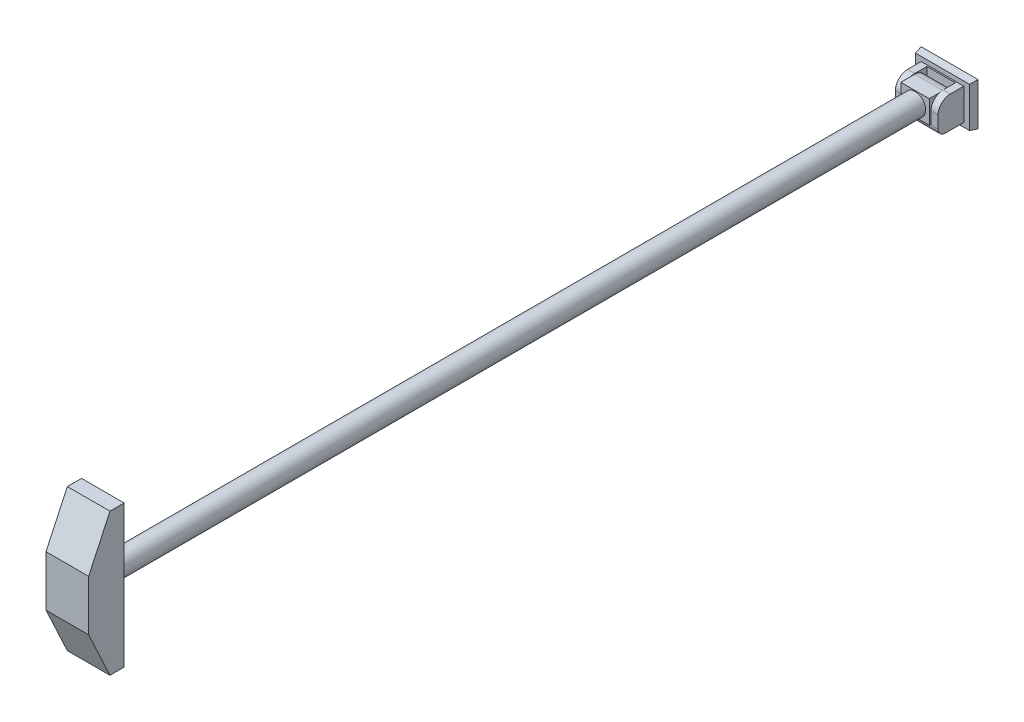
ISO-10303-21;
HEADER;
FILE_DESCRIPTION(('STEP AP214'),'2;1');
FILE_NAME('part.step','',(''),(''),'','','');
FILE_SCHEMA(('AUTOMOTIVE_DESIGN { 1 0 10303 214 1 1 1 1 }'));
ENDSEC;
DATA;
#1=APPLICATION_CONTEXT('core data for automotive mechanical design processes');
#2=APPLICATION_PROTOCOL_DEFINITION('international standard','automotive_design',2000,#1);
#3=PRODUCT_CONTEXT('',#1,'mechanical');
#4=PRODUCT('Part','Part','',(#3));
#5=PRODUCT_RELATED_PRODUCT_CATEGORY('part','',(#4));
#6=PRODUCT_DEFINITION_FORMATION('','',#4);
#7=PRODUCT_DEFINITION_CONTEXT('part definition',#1,'design');
#8=PRODUCT_DEFINITION('design','',#6,#7);
#9=PRODUCT_DEFINITION_SHAPE('','',#8);
#10=(LENGTH_UNIT() NAMED_UNIT(*) SI_UNIT(.MILLI.,.METRE.));
#11=(NAMED_UNIT(*) PLANE_ANGLE_UNIT() SI_UNIT($,.RADIAN.));
#12=(NAMED_UNIT(*) SI_UNIT($,.STERADIAN.) SOLID_ANGLE_UNIT());
#13=UNCERTAINTY_MEASURE_WITH_UNIT(LENGTH_MEASURE(1.E-05),#10,'distance_accuracy_value','');
#14=(GEOMETRIC_REPRESENTATION_CONTEXT(3) GLOBAL_UNCERTAINTY_ASSIGNED_CONTEXT((#13)) GLOBAL_UNIT_ASSIGNED_CONTEXT((#10,
#11,#12)) REPRESENTATION_CONTEXT('',''));
#15=CARTESIAN_POINT('',(0.,0.,0.));
#16=DIRECTION('',(0.,0.,1.));
#17=DIRECTION('',(1.,0.,0.));
#18=AXIS2_PLACEMENT_3D('',#15,#16,#17);
#19=CARTESIAN_POINT('',(-68.3445670265311,20.9540642702172,48.6015988488939));
#20=DIRECTION('',(0.,0.,1.));
#21=DIRECTION('',(1.,0.,0.));
#22=AXIS2_PLACEMENT_3D('',#19,#20,#21);
#23=PLANE('',#22);
#24=DIRECTION('',(0.,1.,0.));
#25=VECTOR('',#24,1.);
#26=CARTESIAN_POINT('',(-20.,20.9540642702172,48.6015988488939));
#27=LINE('',#26,#25);
#28=CARTESIAN_POINT('',(-20.,-11.5155039384287,48.6015988488939));
#29=VERTEX_POINT('',#28);
#30=CARTESIAN_POINT('',(-20.,20.9540642702172,48.6015988488939));
#31=VERTEX_POINT('',#30);
#32=EDGE_CURVE('E267',#29,#31,#27,.T.);
#33=ORIENTED_EDGE('',*,*,#32,.F.);
#34=DIRECTION('',(1.,0.,0.));
#35=VECTOR('',#34,1.);
#36=CARTESIAN_POINT('',(-68.3445670265311,-11.5155039384287,48.6015988488939));
#37=LINE('',#36,#35);
#38=CARTESIAN_POINT('',(20.,-11.5155039384287,48.6015988488939));
#39=VERTEX_POINT('',#38);
#40=EDGE_CURVE('E295',#29,#39,#37,.T.);
#41=ORIENTED_EDGE('',*,*,#40,.T.);
#42=DIRECTION('',(0.,-1.,0.));
#43=VECTOR('',#42,1.);
#44=CARTESIAN_POINT('',(20.,20.9540642702172,48.6015988488939));
#45=LINE('',#44,#43);
#46=CARTESIAN_POINT('',(20.,20.9540642702172,48.6015988488939));
#47=VERTEX_POINT('',#46);
#48=EDGE_CURVE('E283',#47,#39,#45,.T.);
#49=ORIENTED_EDGE('',*,*,#48,.F.);
#50=DIRECTION('',(1.,0.,0.));
#51=VECTOR('',#50,1.);
#52=CARTESIAN_POINT('',(-68.3445670265311,20.9540642702172,48.6015988488939));
#53=LINE('',#52,#51);
#54=EDGE_CURVE('E292',#31,#47,#53,.T.);
#55=ORIENTED_EDGE('',*,*,#54,.F.);
#56=EDGE_LOOP('',(#33,#41,#49,#55));
#57=FACE_BOUND('',#56,.T.);
#58=CARTESIAN_POINT('',(0.,4.71928016589421,48.6015988488939));
#59=DIRECTION('',(0.,0.,1.));
#60=DIRECTION('',(1.,0.,0.));
#61=AXIS2_PLACEMENT_3D('',#58,#59,#60);
#62=CIRCLE('',#61,15.);
#63=CARTESIAN_POINT('',(15.,4.71928016589421,48.6015988488939));
#64=VERTEX_POINT('',#63);
#65=EDGE_CURVE('E232',#64,#64,#62,.T.);
#66=ORIENTED_EDGE('',*,*,#65,.F.);
#67=EDGE_LOOP('',(#66));
#68=FACE_BOUND('',#67,.T.);
#69=ADVANCED_FACE('F32',(#57,#68),#23,.T.);
#70=CARTESIAN_POINT('',(-30.,-22.3686206237099,46.2073731558568));
#71=DIRECTION('',(0.,0.,1.));
#72=DIRECTION('',(1.,0.,0.));
#73=AXIS2_PLACEMENT_3D('',#70,#71,#72);
#74=PLANE('',#73);
#75=DIRECTION('',(0.,-1.,0.));
#76=VECTOR('',#75,1.);
#77=CARTESIAN_POINT('',(-30.,-22.3686206237099,46.2073731558568));
#78=LINE('',#77,#76);
#79=CARTESIAN_POINT('',(-30.,4.71928016589421,46.2073731558568));
#80=VERTEX_POINT('',#79);
#81=CARTESIAN_POINT('',(-30.,-12.3686206237099,46.2073731558568));
#82=VERTEX_POINT('',#81);
#83=EDGE_CURVE('E365',#80,#82,#78,.T.);
#84=ORIENTED_EDGE('',*,*,#83,.T.);
#85=DIRECTION('',(1.,0.,0.));
#86=VECTOR('',#85,1.);
#87=CARTESIAN_POINT('',(-30.,-12.3686206237099,46.2073731558568));
#88=LINE('',#87,#86);
#89=CARTESIAN_POINT('',(-20.,-12.3686206237099,46.2073731558568));
#90=VERTEX_POINT('',#89);
#91=EDGE_CURVE('E416',#82,#90,#88,.T.);
#92=ORIENTED_EDGE('',*,*,#91,.T.);
#93=DIRECTION('',(0.,-1.,0.));
#94=VECTOR('',#93,1.);
#95=CARTESIAN_POINT('',(-20.,-12.4696427147611,46.2073731558568));
#96=LINE('',#95,#94);
#97=CARTESIAN_POINT('',(-20.,-11.5155039384287,46.2073731558568));
#98=VERTEX_POINT('',#97);
#99=EDGE_CURVE('E310',#98,#90,#96,.T.);
#100=ORIENTED_EDGE('',*,*,#99,.F.);
#101=CARTESIAN_POINT('',(-20.,4.71928016589421,46.2073731558568));
#102=VERTEX_POINT('',#101);
#103=EDGE_CURVE('E311',#102,#98,#96,.T.);
#104=ORIENTED_EDGE('',*,*,#103,.F.);
#105=DIRECTION('',(1.,0.,0.));
#106=VECTOR('',#105,1.);
#107=CARTESIAN_POINT('',(-30.,4.71928016589421,46.2073731558568));
#108=LINE('',#107,#106);
#109=EDGE_CURVE('E375',#80,#102,#108,.T.);
#110=ORIENTED_EDGE('',*,*,#109,.F.);
#111=EDGE_LOOP('',(#84,#92,#100,#104,#110));
#112=FACE_BOUND('',#111,.T.);
#113=ADVANCED_FACE('F463',(#112),#74,.T.);
#114=CARTESIAN_POINT('',(-30.,4.71928016589421,29.0184502752014));
#115=DIRECTION('',(1.,0.,0.));
#116=DIRECTION('',(0.,0.,-1.));
#117=AXIS2_PLACEMENT_3D('',#114,#115,#116);
#118=CYLINDRICAL_SURFACE('',#117,17.1889228806553);
#119=ORIENTED_EDGE('',*,*,#109,.T.);
#120=CARTESIAN_POINT('',(-20.,4.71928016589421,29.0184502752014));
#121=DIRECTION('',(1.,0.,0.));
#122=DIRECTION('',(0.,0.,-1.));
#123=AXIS2_PLACEMENT_3D('',#120,#121,#122);
#124=CIRCLE('',#123,17.1889228806553);
#125=CARTESIAN_POINT('',(-20.,20.9540642702172,34.6656491280079));
#126=VERTEX_POINT('',#125);
#127=EDGE_CURVE('E307',#126,#102,#124,.T.);
#128=ORIENTED_EDGE('',*,*,#127,.F.);
#129=CARTESIAN_POINT('',(-20.,21.9082030465495,29.0184502752014));
#130=VERTEX_POINT('',#129);
#131=EDGE_CURVE('E308',#130,#126,#124,.T.);
#132=ORIENTED_EDGE('',*,*,#131,.F.);
#133=DIRECTION('',(1.,0.,0.));
#134=VECTOR('',#133,1.);
#135=CARTESIAN_POINT('',(-30.,21.9082030465495,29.0184502752014));
#136=LINE('',#135,#134);
#137=CARTESIAN_POINT('',(-30.,21.9082030465495,29.0184502752014));
#138=VERTEX_POINT('',#137);
#139=EDGE_CURVE('E379',#138,#130,#136,.T.);
#140=ORIENTED_EDGE('',*,*,#139,.F.);
#141=CARTESIAN_POINT('',(-30.,4.71928016589421,29.0184502752014));
#142=DIRECTION('',(1.,0.,0.));
#143=DIRECTION('',(0.,0.,1.));
#144=AXIS2_PLACEMENT_3D('',#141,#142,#143);
#145=CIRCLE('',#144,17.1889228806553);
#146=EDGE_CURVE('E362',#138,#80,#145,.T.);
#147=ORIENTED_EDGE('',*,*,#146,.T.);
#148=EDGE_LOOP('',(#119,#128,#132,#140,#147));
#149=FACE_BOUND('',#148,.T.);
#150=ADVANCED_FACE('F469',(#149),#118,.T.);
#151=CARTESIAN_POINT('',(40.,30.,0.));
#152=DIRECTION('',(0.984807753012208,0.,0.17364817766693));
#153=DIRECTION('',(0.17364817766693,0.,-0.984807753012208));
#154=AXIS2_PLACEMENT_3D('',#151,#152,#153);
#155=PLANE('',#154);
#156=DIRECTION('',(0.,1.,0.));
#157=VECTOR('',#156,1.);
#158=CARTESIAN_POINT('',(40.,30.,0.));
#159=LINE('',#158,#157);
#160=CARTESIAN_POINT('',(40.,-30.,0.));
#161=VERTEX_POINT('',#160);
#162=CARTESIAN_POINT('',(40.,30.,0.));
#163=VERTEX_POINT('',#162);
#164=EDGE_CURVE('E374',#161,#163,#159,.T.);
#165=ORIENTED_EDGE('',*,*,#164,.T.);
#166=DIRECTION('',(0.171087869746036,0.171087869746036,-0.970287525247814));
#167=VECTOR('',#166,1.);
#168=CARTESIAN_POINT('',(37.6583152660611,27.6583152660611,13.2803540588641));
#169=LINE('',#168,#167);
#170=CARTESIAN_POINT('',(38.2367301929153,28.2367301929154,10.));
#171=VERTEX_POINT('',#170);
#172=EDGE_CURVE('E394',#171,#163,#169,.T.);
#173=ORIENTED_EDGE('',*,*,#172,.F.);
#174=DIRECTION('',(0.,-1.,0.));
#175=VECTOR('',#174,1.);
#176=CARTESIAN_POINT('',(38.2367301929153,30.,10.));
#177=LINE('',#176,#175);
#178=CARTESIAN_POINT('',(38.2367301929153,-28.2367301929153,10.));
#179=VERTEX_POINT('',#178);
#180=EDGE_CURVE('E393',#179,#171,#177,.F.);
#181=ORIENTED_EDGE('',*,*,#180,.F.);
#182=DIRECTION('',(0.171087869746036,-0.171087869746036,-0.970287525247814));
#183=VECTOR('',#182,1.);
#184=CARTESIAN_POINT('',(38.2437364495458,-28.2437364495458,9.96026554414807));
#185=LINE('',#184,#183);
#186=EDGE_CURVE('E399',#179,#161,#185,.T.);
#187=ORIENTED_EDGE('',*,*,#186,.T.);
#188=EDGE_LOOP('',(#165,#173,#181,#187));
#189=FACE_BOUND('',#188,.T.);
#190=ADVANCED_FACE('F539',(#189),#155,.T.);
#191=CARTESIAN_POINT('',(-40.,30.,0.));
#192=DIRECTION('',(0.,0.984807753012208,0.17364817766693));
#193=DIRECTION('',(0.,-0.17364817766693,0.984807753012208));
#194=AXIS2_PLACEMENT_3D('',#191,#192,#193);
#195=PLANE('',#194);
#196=DIRECTION('',(-1.,0.,0.));
#197=VECTOR('',#196,1.);
#198=CARTESIAN_POINT('',(-40.,30.,0.));
#199=LINE('',#198,#197);
#200=CARTESIAN_POINT('',(-40.,30.,0.));
#201=VERTEX_POINT('',#200);
#202=EDGE_CURVE('E387',#163,#201,#199,.T.);
#203=ORIENTED_EDGE('',*,*,#202,.T.);
#204=DIRECTION('',(-0.171087869746036,0.171087869746036,-0.970287525247814));
#205=VECTOR('',#204,1.);
#206=CARTESIAN_POINT('',(-40.,30.,0.));
#207=LINE('',#206,#205);
#208=CARTESIAN_POINT('',(-38.2367301929154,28.2367301929154,10.));
#209=VERTEX_POINT('',#208);
#210=EDGE_CURVE('E398',#209,#201,#207,.T.);
#211=ORIENTED_EDGE('',*,*,#210,.F.);
#212=DIRECTION('',(1.,0.,0.));
#213=VECTOR('',#212,1.);
#214=CARTESIAN_POINT('',(-40.,28.2367301929154,10.));
#215=LINE('',#214,#213);
#216=EDGE_CURVE('E410',#171,#209,#215,.F.);
#217=ORIENTED_EDGE('',*,*,#216,.F.);
#218=ORIENTED_EDGE('',*,*,#172,.T.);
#219=EDGE_LOOP('',(#203,#211,#217,#218));
#220=FACE_BOUND('',#219,.T.);
#221=ADVANCED_FACE('F542',(#220),#195,.T.);
#222=CARTESIAN_POINT('',(-40.,30.,0.));
#223=DIRECTION('',(-0.984807753012208,0.,0.17364817766693));
#224=DIRECTION('',(0.17364817766693,0.,0.984807753012208));
#225=AXIS2_PLACEMENT_3D('',#222,#223,#224);
#226=PLANE('',#225);
#227=DIRECTION('',(0.,-1.,0.));
#228=VECTOR('',#227,1.);
#229=CARTESIAN_POINT('',(-40.,30.,0.));
#230=LINE('',#229,#228);
#231=CARTESIAN_POINT('',(-40.,-30.,0.));
#232=VERTEX_POINT('',#231);
#233=EDGE_CURVE('E389',#201,#232,#230,.T.);
#234=ORIENTED_EDGE('',*,*,#233,.T.);
#235=DIRECTION('',(-0.171087869746036,-0.171087869746036,-0.970287525247814));
#236=VECTOR('',#235,1.);
#237=CARTESIAN_POINT('',(-40.,-30.,0.));
#238=LINE('',#237,#236);
#239=CARTESIAN_POINT('',(-38.2367301929154,-28.2367301929153,10.));
#240=VERTEX_POINT('',#239);
#241=EDGE_CURVE('E402',#240,#232,#238,.T.);
#242=ORIENTED_EDGE('',*,*,#241,.F.);
#243=DIRECTION('',(0.,1.,0.));
#244=VECTOR('',#243,1.);
#245=CARTESIAN_POINT('',(-38.2367301929154,30.,10.));
#246=LINE('',#245,#244);
#247=EDGE_CURVE('E412',#209,#240,#246,.F.);
#248=ORIENTED_EDGE('',*,*,#247,.F.);
#249=ORIENTED_EDGE('',*,*,#210,.T.);
#250=EDGE_LOOP('',(#234,#242,#248,#249));
#251=FACE_BOUND('',#250,.T.);
#252=ADVANCED_FACE('F546',(#251),#226,.T.);
#253=CARTESIAN_POINT('',(-40.,-30.,0.));
#254=DIRECTION('',(0.,-0.984807753012208,0.17364817766693));
#255=DIRECTION('',(0.,-0.17364817766693,-0.984807753012208));
#256=AXIS2_PLACEMENT_3D('',#253,#254,#255);
#257=PLANE('',#256);
#258=DIRECTION('',(1.,0.,0.));
#259=VECTOR('',#258,1.);
#260=CARTESIAN_POINT('',(-40.,-30.,0.));
#261=LINE('',#260,#259);
#262=EDGE_CURVE('E391',#232,#161,#261,.T.);
#263=ORIENTED_EDGE('',*,*,#262,.T.);
#264=ORIENTED_EDGE('',*,*,#186,.F.);
#265=DIRECTION('',(-1.,0.,0.));
#266=VECTOR('',#265,1.);
#267=CARTESIAN_POINT('',(-40.,-28.2367301929153,10.));
#268=LINE('',#267,#266);
#269=EDGE_CURVE('E403',#240,#179,#268,.F.);
#270=ORIENTED_EDGE('',*,*,#269,.F.);
#271=ORIENTED_EDGE('',*,*,#241,.T.);
#272=EDGE_LOOP('',(#263,#264,#270,#271));
#273=FACE_BOUND('',#272,.T.);
#274=ADVANCED_FACE('F534',(#273),#257,.T.);
#275=CARTESIAN_POINT('',(0.,0.,10.));
#276=DIRECTION('',(0.,0.,1.));
#277=DIRECTION('',(1.,0.,0.));
#278=AXIS2_PLACEMENT_3D('',#275,#276,#277);
#279=PLANE('',#278);
#280=DIRECTION('',(0.,1.,0.));
#281=VECTOR('',#280,1.);
#282=CARTESIAN_POINT('',(-30.,21.9082030465495,10.));
#283=LINE('',#282,#281);
#284=CARTESIAN_POINT('',(-30.,-22.3686206237099,10.));
#285=VERTEX_POINT('',#284);
#286=CARTESIAN_POINT('',(-30.,21.9082030465495,10.));
#287=VERTEX_POINT('',#286);
#288=EDGE_CURVE('E356',#285,#287,#283,.T.);
#289=ORIENTED_EDGE('',*,*,#288,.T.);
#290=DIRECTION('',(1.,0.,0.));
#291=VECTOR('',#290,1.);
#292=CARTESIAN_POINT('',(-30.,21.9082030465495,10.));
#293=LINE('',#292,#291);
#294=CARTESIAN_POINT('',(30.,21.9082030465495,10.));
#295=VERTEX_POINT('',#294);
#296=EDGE_CURVE('E370',#287,#295,#293,.T.);
#297=ORIENTED_EDGE('',*,*,#296,.T.);
#298=DIRECTION('',(0.,1.,0.));
#299=VECTOR('',#298,1.);
#300=CARTESIAN_POINT('',(30.,21.9082030465495,10.));
#301=LINE('',#300,#299);
#302=CARTESIAN_POINT('',(30.,-22.3686206237099,10.));
#303=VERTEX_POINT('',#302);
#304=EDGE_CURVE('E342',#303,#295,#301,.T.);
#305=ORIENTED_EDGE('',*,*,#304,.F.);
#306=DIRECTION('',(1.,0.,0.));
#307=VECTOR('',#306,1.);
#308=CARTESIAN_POINT('',(-30.,-22.3686206237099,10.));
#309=LINE('',#308,#307);
#310=EDGE_CURVE('E371',#285,#303,#309,.T.);
#311=ORIENTED_EDGE('',*,*,#310,.F.);
#312=EDGE_LOOP('',(#289,#297,#305,#311));
#313=FACE_BOUND('',#312,.T.);
#314=ORIENTED_EDGE('',*,*,#180,.T.);
#315=ORIENTED_EDGE('',*,*,#216,.T.);
#316=ORIENTED_EDGE('',*,*,#247,.T.);
#317=ORIENTED_EDGE('',*,*,#269,.T.);
#318=EDGE_LOOP('',(#314,#315,#316,#317));
#319=FACE_BOUND('',#318,.T.);
#320=ADVANCED_FACE('F531',(#313,#319),#279,.T.);
#321=CARTESIAN_POINT('',(0.,0.,0.));
#322=DIRECTION('',(0.,0.,1.));
#323=DIRECTION('',(1.,0.,0.));
#324=AXIS2_PLACEMENT_3D('',#321,#322,#323);
#325=PLANE('',#324);
#326=ORIENTED_EDGE('',*,*,#164,.F.);
#327=ORIENTED_EDGE('',*,*,#262,.F.);
#328=ORIENTED_EDGE('',*,*,#233,.F.);
#329=ORIENTED_EDGE('',*,*,#202,.F.);
#330=EDGE_LOOP('',(#326,#327,#328,#329));
#331=FACE_BOUND('',#330,.T.);
#332=ADVANCED_FACE('F519',(#331),#325,.F.);
#333=CARTESIAN_POINT('',(-30.,-22.3686206237099,10.));
#334=DIRECTION('',(0.,-1.,0.));
#335=DIRECTION('',(0.,0.,-1.));
#336=AXIS2_PLACEMENT_3D('',#333,#334,#335);
#337=PLANE('',#336);
#338=DIRECTION('',(0.,0.,-1.));
#339=VECTOR('',#338,1.);
#340=CARTESIAN_POINT('',(30.,-22.3686206237099,10.));
#341=LINE('',#340,#339);
#342=CARTESIAN_POINT('',(30.,-22.3686206237099,36.2073731558568));
#343=VERTEX_POINT('',#342);
#344=EDGE_CURVE('E354',#343,#303,#341,.T.);
#345=ORIENTED_EDGE('',*,*,#344,.F.);
#346=DIRECTION('',(1.,0.,0.));
#347=VECTOR('',#346,1.);
#348=CARTESIAN_POINT('',(-30.,-22.3686206237099,36.2073731558568));
#349=LINE('',#348,#347);
#350=CARTESIAN_POINT('',(-30.,-22.3686206237099,36.2073731558568));
#351=VERTEX_POINT('',#350);
#352=EDGE_CURVE('E428',#343,#351,#349,.F.);
#353=ORIENTED_EDGE('',*,*,#352,.T.);
#354=DIRECTION('',(0.,0.,-1.));
#355=VECTOR('',#354,1.);
#356=CARTESIAN_POINT('',(-30.,-22.3686206237099,10.));
#357=LINE('',#356,#355);
#358=EDGE_CURVE('E368',#351,#285,#357,.T.);
#359=ORIENTED_EDGE('',*,*,#358,.T.);
#360=ORIENTED_EDGE('',*,*,#310,.T.);
#361=EDGE_LOOP('',(#345,#353,#359,#360));
#362=FACE_BOUND('',#361,.T.);
#363=ADVANCED_FACE('F517',(#362),#337,.T.);
#364=DIRECTION('',(0.,-1.,0.));
#365=VECTOR('',#364,1.);
#366=CARTESIAN_POINT('',(20.,-12.4696427147611,46.2073731558568));
#367=LINE('',#366,#365);
#368=CARTESIAN_POINT('',(20.,4.71928016589421,46.2073731558568));
#369=VERTEX_POINT('',#368);
#370=CARTESIAN_POINT('',(20.,-11.5155039384287,46.2073731558568));
#371=VERTEX_POINT('',#370);
#372=EDGE_CURVE('E329',#369,#371,#367,.T.);
#373=ORIENTED_EDGE('',*,*,#372,.T.);
#374=CARTESIAN_POINT('',(20.,-12.3686206237099,46.2073731558568));
#375=VERTEX_POINT('',#374);
#376=EDGE_CURVE('E328',#371,#375,#367,.T.);
#377=ORIENTED_EDGE('',*,*,#376,.T.);
#378=DIRECTION('',(1.,0.,0.));
#379=VECTOR('',#378,1.);
#380=CARTESIAN_POINT('',(-30.,-12.3686206237099,46.2073731558568));
#381=LINE('',#380,#379);
#382=CARTESIAN_POINT('',(30.,-12.3686206237099,46.2073731558568));
#383=VERTEX_POINT('',#382);
#384=EDGE_CURVE('E397',#375,#383,#381,.T.);
#385=ORIENTED_EDGE('',*,*,#384,.T.);
#386=DIRECTION('',(0.,-1.,0.));
#387=VECTOR('',#386,1.);
#388=CARTESIAN_POINT('',(30.,-22.3686206237099,46.2073731558568));
#389=LINE('',#388,#387);
#390=CARTESIAN_POINT('',(30.,4.71928016589421,46.2073731558568));
#391=VERTEX_POINT('',#390);
#392=EDGE_CURVE('E351',#391,#383,#389,.T.);
#393=ORIENTED_EDGE('',*,*,#392,.F.);
#394=EDGE_CURVE('E378',#369,#391,#108,.T.);
#395=ORIENTED_EDGE('',*,*,#394,.F.);
#396=EDGE_LOOP('',(#373,#377,#385,#393,#395));
#397=FACE_BOUND('',#396,.T.);
#398=ADVANCED_FACE('F472',(#397),#74,.T.);
#399=CARTESIAN_POINT('',(20.,4.71928016589421,29.0184502752014));
#400=DIRECTION('',(1.,0.,0.));
#401=DIRECTION('',(0.,0.,-1.));
#402=AXIS2_PLACEMENT_3D('',#399,#400,#401);
#403=CIRCLE('',#402,17.1889228806553);
#404=CARTESIAN_POINT('',(20.,21.9082030465495,29.0184502752014));
#405=VERTEX_POINT('',#404);
#406=CARTESIAN_POINT('',(20.,20.9540642702172,34.6656491280079));
#407=VERTEX_POINT('',#406);
#408=EDGE_CURVE('E325',#405,#407,#403,.T.);
#409=ORIENTED_EDGE('',*,*,#408,.T.);
#410=EDGE_CURVE('E324',#407,#369,#403,.T.);
#411=ORIENTED_EDGE('',*,*,#410,.T.);
#412=ORIENTED_EDGE('',*,*,#394,.T.);
#413=CARTESIAN_POINT('',(30.,4.71928016589421,29.0184502752014));
#414=DIRECTION('',(1.,0.,0.));
#415=DIRECTION('',(0.,0.,1.));
#416=AXIS2_PLACEMENT_3D('',#413,#414,#415);
#417=CIRCLE('',#416,17.1889228806553);
#418=CARTESIAN_POINT('',(30.,21.9082030465495,29.0184502752014));
#419=VERTEX_POINT('',#418);
#420=EDGE_CURVE('E348',#419,#391,#417,.T.);
#421=ORIENTED_EDGE('',*,*,#420,.F.);
#422=EDGE_CURVE('E382',#405,#419,#136,.T.);
#423=ORIENTED_EDGE('',*,*,#422,.F.);
#424=EDGE_LOOP('',(#409,#411,#412,#421,#423));
#425=FACE_BOUND('',#424,.T.);
#426=ADVANCED_FACE('F523',(#425),#118,.T.);
#427=CARTESIAN_POINT('',(-30.,21.9082030465495,29.0184502752014));
#428=DIRECTION('',(0.,1.,0.));
#429=DIRECTION('',(0.,0.,1.));
#430=AXIS2_PLACEMENT_3D('',#427,#428,#429);
#431=PLANE('',#430);
#432=DIRECTION('',(0.,0.,1.));
#433=VECTOR('',#432,1.);
#434=CARTESIAN_POINT('',(20.,21.9082030465495,11.8295273945461));
#435=LINE('',#434,#433);
#436=CARTESIAN_POINT('',(20.,21.9082030465495,11.8295273945461));
#437=VERTEX_POINT('',#436);
#438=EDGE_CURVE('E321',#437,#405,#435,.T.);
#439=ORIENTED_EDGE('',*,*,#438,.T.);
#440=ORIENTED_EDGE('',*,*,#422,.T.);
#441=DIRECTION('',(0.,0.,1.));
#442=VECTOR('',#441,1.);
#443=CARTESIAN_POINT('',(30.,21.9082030465495,29.0184502752014));
#444=LINE('',#443,#442);
#445=EDGE_CURVE('E345',#295,#419,#444,.T.);
#446=ORIENTED_EDGE('',*,*,#445,.F.);
#447=ORIENTED_EDGE('',*,*,#296,.F.);
#448=DIRECTION('',(0.,0.,1.));
#449=VECTOR('',#448,1.);
#450=CARTESIAN_POINT('',(-30.,21.9082030465495,29.0184502752014));
#451=LINE('',#450,#449);
#452=EDGE_CURVE('E359',#287,#138,#451,.T.);
#453=ORIENTED_EDGE('',*,*,#452,.T.);
#454=ORIENTED_EDGE('',*,*,#139,.T.);
#455=DIRECTION('',(0.,0.,1.));
#456=VECTOR('',#455,1.);
#457=CARTESIAN_POINT('',(-20.,21.9082030465495,11.8295273945461));
#458=LINE('',#457,#456);
#459=CARTESIAN_POINT('',(-20.,21.9082030465495,11.8295273945461));
#460=VERTEX_POINT('',#459);
#461=EDGE_CURVE('E305',#460,#130,#458,.T.);
#462=ORIENTED_EDGE('',*,*,#461,.F.);
#463=DIRECTION('',(-1.,0.,0.));
#464=VECTOR('',#463,1.);
#465=CARTESIAN_POINT('',(20.,21.9082030465495,11.8295273945461));
#466=LINE('',#465,#464);
#467=EDGE_CURVE('E337',#437,#460,#466,.T.);
#468=ORIENTED_EDGE('',*,*,#467,.F.);
#469=EDGE_LOOP('',(#439,#440,#446,#447,#453,#454,#462,#468));
#470=FACE_BOUND('',#469,.T.);
#471=ADVANCED_FACE('F515',(#470),#431,.T.);
#472=CARTESIAN_POINT('',(-30.,4.71928016589421,29.0184502752014));
#473=DIRECTION('',(-1.,0.,0.));
#474=DIRECTION('',(0.,0.,1.));
#475=AXIS2_PLACEMENT_3D('',#472,#473,#474);
#476=PLANE('',#475);
#477=ORIENTED_EDGE('',*,*,#358,.F.);
#478=CARTESIAN_POINT('',(-30.,-12.3686206237099,36.2073731558568));
#479=DIRECTION('',(-1.,0.,0.));
#480=DIRECTION('',(0.,0.,1.));
#481=AXIS2_PLACEMENT_3D('',#478,#479,#480);
#482=CIRCLE('',#481,10.);
#483=EDGE_CURVE('E430',#351,#82,#482,.T.);
#484=ORIENTED_EDGE('',*,*,#483,.T.);
#485=ORIENTED_EDGE('',*,*,#83,.F.);
#486=ORIENTED_EDGE('',*,*,#146,.F.);
#487=ORIENTED_EDGE('',*,*,#452,.F.);
#488=ORIENTED_EDGE('',*,*,#288,.F.);
#489=EDGE_LOOP('',(#477,#484,#485,#486,#487,#488));
#490=FACE_BOUND('',#489,.T.);
#491=ADVANCED_FACE('F511',(#490),#476,.T.);
#492=CARTESIAN_POINT('',(30.,4.71928016589421,29.0184502752014));
#493=DIRECTION('',(-1.,0.,0.));
#494=DIRECTION('',(0.,0.,1.));
#495=AXIS2_PLACEMENT_3D('',#492,#493,#494);
#496=PLANE('',#495);
#497=ORIENTED_EDGE('',*,*,#392,.T.);
#498=CARTESIAN_POINT('',(30.,-12.3686206237099,36.2073731558568));
#499=DIRECTION('',(-1.,0.,0.));
#500=DIRECTION('',(0.,0.,1.));
#501=AXIS2_PLACEMENT_3D('',#498,#499,#500);
#502=CIRCLE('',#501,10.);
#503=EDGE_CURVE('E426',#383,#343,#502,.F.);
#504=ORIENTED_EDGE('',*,*,#503,.T.);
#505=ORIENTED_EDGE('',*,*,#344,.T.);
#506=ORIENTED_EDGE('',*,*,#304,.T.);
#507=ORIENTED_EDGE('',*,*,#445,.T.);
#508=ORIENTED_EDGE('',*,*,#420,.T.);
#509=EDGE_LOOP('',(#497,#504,#505,#506,#507,#508));
#510=FACE_BOUND('',#509,.T.);
#511=ADVANCED_FACE('F507',(#510),#496,.F.);
#512=CARTESIAN_POINT('',(20.,4.71928016589421,29.0184502752014));
#513=DIRECTION('',(-1.,0.,0.));
#514=DIRECTION('',(0.,0.,1.));
#515=AXIS2_PLACEMENT_3D('',#512,#513,#514);
#516=CYLINDRICAL_SURFACE('',#515,17.1889228806553);
#517=DIRECTION('',(-1.,0.,0.));
#518=VECTOR('',#517,1.);
#519=CARTESIAN_POINT('',(20.,-12.4696427147611,29.0184502752014));
#520=LINE('',#519,#518);
#521=CARTESIAN_POINT('',(20.,-12.4696427147611,29.0184502752014));
#522=VERTEX_POINT('',#521);
#523=CARTESIAN_POINT('',(-20.,-12.4696427147611,29.0184502752014));
#524=VERTEX_POINT('',#523);
#525=EDGE_CURVE('E334',#522,#524,#520,.T.);
#526=ORIENTED_EDGE('',*,*,#525,.F.);
#527=CARTESIAN_POINT('',(20.,4.71928016589421,29.0184502752014));
#528=DIRECTION('',(1.,0.,0.));
#529=DIRECTION('',(0.,0.,-1.));
#530=AXIS2_PLACEMENT_3D('',#527,#528,#529);
#531=CIRCLE('',#530,17.1889228806553);
#532=CARTESIAN_POINT('',(20.,4.71928016589421,11.8295273945461));
#533=VERTEX_POINT('',#532);
#534=EDGE_CURVE('E316',#522,#533,#531,.T.);
#535=ORIENTED_EDGE('',*,*,#534,.T.);
#536=DIRECTION('',(-1.,0.,0.));
#537=VECTOR('',#536,1.);
#538=CARTESIAN_POINT('',(20.,4.71928016589421,11.8295273945461));
#539=LINE('',#538,#537);
#540=CARTESIAN_POINT('',(-20.,4.71928016589421,11.8295273945461));
#541=VERTEX_POINT('',#540);
#542=EDGE_CURVE('E340',#533,#541,#539,.T.);
#543=ORIENTED_EDGE('',*,*,#542,.T.);
#544=CARTESIAN_POINT('',(-20.,4.71928016589421,29.0184502752014));
#545=DIRECTION('',(1.,0.,0.));
#546=DIRECTION('',(0.,0.,-1.));
#547=AXIS2_PLACEMENT_3D('',#544,#545,#546);
#548=CIRCLE('',#547,17.1889228806553);
#549=EDGE_CURVE('E300',#524,#541,#548,.T.);
#550=ORIENTED_EDGE('',*,*,#549,.F.);
#551=EDGE_LOOP('',(#526,#535,#543,#550));
#552=FACE_BOUND('',#551,.T.);
#553=ADVANCED_FACE('F503',(#552),#516,.F.);
#554=CARTESIAN_POINT('',(20.,4.71928016589421,11.8295273945461));
#555=DIRECTION('',(0.,0.,1.));
#556=DIRECTION('',(1.,0.,0.));
#557=AXIS2_PLACEMENT_3D('',#554,#555,#556);
#558=PLANE('',#557);
#559=ORIENTED_EDGE('',*,*,#542,.F.);
#560=DIRECTION('',(0.,1.,0.));
#561=VECTOR('',#560,1.);
#562=CARTESIAN_POINT('',(20.,4.71928016589421,11.8295273945461));
#563=LINE('',#562,#561);
#564=EDGE_CURVE('E319',#533,#437,#563,.T.);
#565=ORIENTED_EDGE('',*,*,#564,.T.);
#566=ORIENTED_EDGE('',*,*,#467,.T.);
#567=DIRECTION('',(0.,1.,0.));
#568=VECTOR('',#567,1.);
#569=CARTESIAN_POINT('',(-20.,4.71928016589421,11.8295273945461));
#570=LINE('',#569,#568);
#571=EDGE_CURVE('E303',#541,#460,#570,.T.);
#572=ORIENTED_EDGE('',*,*,#571,.F.);
#573=EDGE_LOOP('',(#559,#565,#566,#572));
#574=FACE_BOUND('',#573,.T.);
#575=ADVANCED_FACE('F499',(#574),#558,.T.);
#576=CARTESIAN_POINT('',(20.,-12.4696427147611,29.0184502752014));
#577=DIRECTION('',(0.,1.,0.));
#578=DIRECTION('',(0.,0.,1.));
#579=AXIS2_PLACEMENT_3D('',#576,#577,#578);
#580=PLANE('',#579);
#581=DIRECTION('',(0.,0.,-1.));
#582=VECTOR('',#581,1.);
#583=CARTESIAN_POINT('',(-20.,-12.4696427147611,29.0184502752014));
#584=LINE('',#583,#582);
#585=CARTESIAN_POINT('',(-20.,-12.4696427147611,46.2068628696931));
#586=VERTEX_POINT('',#585);
#587=EDGE_CURVE('E314',#586,#524,#584,.T.);
#588=ORIENTED_EDGE('',*,*,#587,.F.);
#589=DIRECTION('',(1.,0.,0.));
#590=VECTOR('',#589,1.);
#591=CARTESIAN_POINT('',(-20.,-12.4696427147611,46.2068628696931));
#592=LINE('',#591,#590);
#593=CARTESIAN_POINT('',(20.,-12.4696427147611,46.2068628696931));
#594=VERTEX_POINT('',#593);
#595=EDGE_CURVE('E421',#586,#594,#592,.T.);
#596=ORIENTED_EDGE('',*,*,#595,.T.);
#597=DIRECTION('',(0.,0.,-1.));
#598=VECTOR('',#597,1.);
#599=CARTESIAN_POINT('',(20.,-12.4696427147611,29.0184502752014));
#600=LINE('',#599,#598);
#601=EDGE_CURVE('E332',#594,#522,#600,.T.);
#602=ORIENTED_EDGE('',*,*,#601,.T.);
#603=ORIENTED_EDGE('',*,*,#525,.T.);
#604=EDGE_LOOP('',(#588,#596,#602,#603));
#605=FACE_BOUND('',#604,.T.);
#606=ADVANCED_FACE('F495',(#605),#580,.T.);
#607=CARTESIAN_POINT('',(20.,4.71928016589421,29.0184502752014));
#608=DIRECTION('',(1.,0.,0.));
#609=DIRECTION('',(0.,0.,-1.));
#610=AXIS2_PLACEMENT_3D('',#607,#608,#609);
#611=PLANE('',#610);
#612=ORIENTED_EDGE('',*,*,#376,.F.);
#613=DIRECTION('',(0.,0.,-1.));
#614=VECTOR('',#613,1.);
#615=CARTESIAN_POINT('',(20.,-11.5155039384287,48.6015988488939));
#616=LINE('',#615,#614);
#617=CARTESIAN_POINT('',(20.,-11.5155039384287,29.0184502752014));
#618=VERTEX_POINT('',#617);
#619=EDGE_CURVE('E279',#371,#618,#616,.T.);
#620=ORIENTED_EDGE('',*,*,#619,.T.);
#621=CARTESIAN_POINT('',(20.,4.71928016589421,29.0184502752014));
#622=DIRECTION('',(-1.,0.,0.));
#623=DIRECTION('',(0.,0.,1.));
#624=AXIS2_PLACEMENT_3D('',#621,#622,#623);
#625=CIRCLE('',#624,16.234784104323);
#626=CARTESIAN_POINT('',(20.,20.9540642702172,29.0184502752014));
#627=VERTEX_POINT('',#626);
#628=EDGE_CURVE('E264',#627,#618,#625,.T.);
#629=ORIENTED_EDGE('',*,*,#628,.F.);
#630=DIRECTION('',(0.,0.,1.));
#631=VECTOR('',#630,1.);
#632=CARTESIAN_POINT('',(20.,20.9540642702172,29.0184502752014));
#633=LINE('',#632,#631);
#634=EDGE_CURVE('E287',#627,#407,#633,.T.);
#635=ORIENTED_EDGE('',*,*,#634,.T.);
#636=ORIENTED_EDGE('',*,*,#408,.F.);
#637=ORIENTED_EDGE('',*,*,#438,.F.);
#638=ORIENTED_EDGE('',*,*,#564,.F.);
#639=ORIENTED_EDGE('',*,*,#534,.F.);
#640=ORIENTED_EDGE('',*,*,#601,.F.);
#641=CARTESIAN_POINT('',(20.,-12.3686206237099,36.2073731558568));
#642=DIRECTION('',(1.,0.,0.));
#643=DIRECTION('',(0.,0.,-1.));
#644=AXIS2_PLACEMENT_3D('',#641,#642,#643);
#645=CIRCLE('',#644,10.);
#646=EDGE_CURVE('E423',#594,#375,#645,.F.);
#647=ORIENTED_EDGE('',*,*,#646,.T.);
#648=EDGE_LOOP('',(#612,#620,#629,#635,#636,#637,#638,#639,#640,#647));
#649=FACE_BOUND('',#648,.T.);
#650=ADVANCED_FACE('F491',(#649),#611,.F.);
#651=CARTESIAN_POINT('',(-20.,4.71928016589421,29.0184502752014));
#652=DIRECTION('',(1.,0.,0.));
#653=DIRECTION('',(0.,0.,-1.));
#654=AXIS2_PLACEMENT_3D('',#651,#652,#653);
#655=PLANE('',#654);
#656=DIRECTION('',(0.,0.,1.));
#657=VECTOR('',#656,1.);
#658=CARTESIAN_POINT('',(-20.,-11.5155039384287,48.6015988488939));
#659=LINE('',#658,#657);
#660=CARTESIAN_POINT('',(-20.,-11.5155039384287,29.0184502752014));
#661=VERTEX_POINT('',#660);
#662=EDGE_CURVE('E271',#661,#98,#659,.T.);
#663=ORIENTED_EDGE('',*,*,#662,.T.);
#664=ORIENTED_EDGE('',*,*,#99,.T.);
#665=CARTESIAN_POINT('',(-20.,-12.3686206237099,36.2073731558568));
#666=DIRECTION('',(1.,0.,0.));
#667=DIRECTION('',(0.,0.,-1.));
#668=AXIS2_PLACEMENT_3D('',#665,#666,#667);
#669=CIRCLE('',#668,10.);
#670=EDGE_CURVE('E419',#90,#586,#669,.T.);
#671=ORIENTED_EDGE('',*,*,#670,.T.);
#672=ORIENTED_EDGE('',*,*,#587,.T.);
#673=ORIENTED_EDGE('',*,*,#549,.T.);
#674=ORIENTED_EDGE('',*,*,#571,.T.);
#675=ORIENTED_EDGE('',*,*,#461,.T.);
#676=ORIENTED_EDGE('',*,*,#131,.T.);
#677=DIRECTION('',(0.,0.,1.));
#678=VECTOR('',#677,1.);
#679=CARTESIAN_POINT('',(-20.,20.9540642702172,29.0184502752014));
#680=LINE('',#679,#678);
#681=CARTESIAN_POINT('',(-20.,20.9540642702172,29.0184502752014));
#682=VERTEX_POINT('',#681);
#683=EDGE_CURVE('E432',#682,#126,#680,.T.);
#684=ORIENTED_EDGE('',*,*,#683,.F.);
#685=CARTESIAN_POINT('',(-20.,4.71928016589421,29.0184502752014));
#686=DIRECTION('',(1.,0.,0.));
#687=DIRECTION('',(0.,0.,-1.));
#688=AXIS2_PLACEMENT_3D('',#685,#686,#687);
#689=CIRCLE('',#688,16.234784104323);
#690=EDGE_CURVE('E273',#661,#682,#689,.T.);
#691=ORIENTED_EDGE('',*,*,#690,.F.);
#692=EDGE_LOOP('',(#663,#664,#671,#672,#673,#674,#675,#676,#684,#691));
#693=FACE_BOUND('',#692,.T.);
#694=ADVANCED_FACE('F488',(#693),#655,.T.);
#695=CARTESIAN_POINT('',(-30.,-12.3686206237099,36.2073731558568));
#696=DIRECTION('',(1.,0.,0.));
#697=DIRECTION('',(0.,0.,-1.));
#698=AXIS2_PLACEMENT_3D('',#695,#696,#697);
#699=CYLINDRICAL_SURFACE('',#698,10.);
#700=ORIENTED_EDGE('',*,*,#483,.F.);
#701=ORIENTED_EDGE('',*,*,#352,.F.);
#702=ORIENTED_EDGE('',*,*,#503,.F.);
#703=ORIENTED_EDGE('',*,*,#384,.F.);
#704=ORIENTED_EDGE('',*,*,#646,.F.);
#705=ORIENTED_EDGE('',*,*,#595,.F.);
#706=ORIENTED_EDGE('',*,*,#670,.F.);
#707=ORIENTED_EDGE('',*,*,#91,.F.);
#708=EDGE_LOOP('',(#700,#701,#702,#703,#704,#705,#706,#707));
#709=FACE_BOUND('',#708,.T.);
#710=ADVANCED_FACE('F486',(#709),#699,.T.);
#711=CARTESIAN_POINT('',(-68.3445670265311,4.71928016589421,29.0184502752014));
#712=DIRECTION('',(1.,0.,0.));
#713=DIRECTION('',(0.,0.,-1.));
#714=AXIS2_PLACEMENT_3D('',#711,#712,#713);
#715=CYLINDRICAL_SURFACE('',#714,16.234784104323);
#716=DIRECTION('',(1.,0.,0.));
#717=VECTOR('',#716,1.);
#718=CARTESIAN_POINT('',(-68.3445670265311,-11.5155039384287,29.0184502752014));
#719=LINE('',#718,#717);
#720=EDGE_CURVE('E270',#661,#618,#719,.T.);
#721=ORIENTED_EDGE('',*,*,#720,.F.);
#722=ORIENTED_EDGE('',*,*,#690,.T.);
#723=DIRECTION('',(1.,0.,0.));
#724=VECTOR('',#723,1.);
#725=CARTESIAN_POINT('',(-68.3445670265311,20.9540642702172,29.0184502752014));
#726=LINE('',#725,#724);
#727=EDGE_CURVE('E290',#682,#627,#726,.T.);
#728=ORIENTED_EDGE('',*,*,#727,.T.);
#729=ORIENTED_EDGE('',*,*,#628,.T.);
#730=EDGE_LOOP('',(#721,#722,#728,#729));
#731=FACE_BOUND('',#730,.T.);
#732=ADVANCED_FACE('F482',(#731),#715,.T.);
#733=CARTESIAN_POINT('',(-68.3445670265311,-11.5155039384287,48.6015988488939));
#734=DIRECTION('',(0.,-1.,0.));
#735=DIRECTION('',(0.,0.,-1.));
#736=AXIS2_PLACEMENT_3D('',#733,#734,#735);
#737=PLANE('',#736);
#738=ORIENTED_EDGE('',*,*,#662,.F.);
#739=ORIENTED_EDGE('',*,*,#720,.T.);
#740=ORIENTED_EDGE('',*,*,#619,.F.);
#741=EDGE_CURVE('E280',#39,#371,#616,.T.);
#742=ORIENTED_EDGE('',*,*,#741,.F.);
#743=ORIENTED_EDGE('',*,*,#40,.F.);
#744=EDGE_CURVE('E269',#98,#29,#659,.T.);
#745=ORIENTED_EDGE('',*,*,#744,.F.);
#746=EDGE_LOOP('',(#738,#739,#740,#742,#743,#745));
#747=FACE_BOUND('',#746,.T.);
#748=ADVANCED_FACE('F479',(#747),#737,.T.);
#749=CARTESIAN_POINT('',(-68.3445670265311,20.9540642702172,29.0184502752014));
#750=DIRECTION('',(0.,1.,0.));
#751=DIRECTION('',(0.,0.,1.));
#752=AXIS2_PLACEMENT_3D('',#749,#750,#751);
#753=PLANE('',#752);
#754=DIRECTION('',(0.,0.,-1.));
#755=VECTOR('',#754,1.);
#756=CARTESIAN_POINT('',(-20.,20.9540642702172,29.0184502752014));
#757=LINE('',#756,#755);
#758=EDGE_CURVE('E276',#31,#126,#757,.T.);
#759=ORIENTED_EDGE('',*,*,#758,.F.);
#760=ORIENTED_EDGE('',*,*,#54,.T.);
#761=EDGE_CURVE('E286',#407,#47,#633,.T.);
#762=ORIENTED_EDGE('',*,*,#761,.F.);
#763=ORIENTED_EDGE('',*,*,#634,.F.);
#764=ORIENTED_EDGE('',*,*,#727,.F.);
#765=ORIENTED_EDGE('',*,*,#683,.T.);
#766=EDGE_LOOP('',(#759,#760,#762,#763,#764,#765));
#767=FACE_BOUND('',#766,.T.);
#768=ADVANCED_FACE('F477',(#767),#753,.T.);
#769=CARTESIAN_POINT('',(20.,4.71928016589421,29.0184502752014));
#770=DIRECTION('',(-1.,0.,0.));
#771=DIRECTION('',(0.,0.,1.));
#772=AXIS2_PLACEMENT_3D('',#769,#770,#771);
#773=PLANE('',#772);
#774=ORIENTED_EDGE('',*,*,#372,.F.);
#775=ORIENTED_EDGE('',*,*,#410,.F.);
#776=ORIENTED_EDGE('',*,*,#761,.T.);
#777=ORIENTED_EDGE('',*,*,#48,.T.);
#778=ORIENTED_EDGE('',*,*,#741,.T.);
#779=EDGE_LOOP('',(#774,#775,#776,#777,#778));
#780=FACE_BOUND('',#779,.T.);
#781=ADVANCED_FACE('F613',(#780),#773,.F.);
#782=CARTESIAN_POINT('',(-20.,4.71928016589421,29.0184502752014));
#783=DIRECTION('',(1.,0.,0.));
#784=DIRECTION('',(0.,0.,-1.));
#785=AXIS2_PLACEMENT_3D('',#782,#783,#784);
#786=PLANE('',#785);
#787=ORIENTED_EDGE('',*,*,#103,.T.);
#788=ORIENTED_EDGE('',*,*,#744,.T.);
#789=ORIENTED_EDGE('',*,*,#32,.T.);
#790=ORIENTED_EDGE('',*,*,#758,.T.);
#791=ORIENTED_EDGE('',*,*,#127,.T.);
#792=EDGE_LOOP('',(#787,#788,#789,#790,#791));
#793=FACE_BOUND('',#792,.T.);
#794=ADVANCED_FACE('F573',(#793),#786,.F.);
#795=CARTESIAN_POINT('',(0.,4.71928016589421,1191.60159884889));
#796=DIRECTION('',(0.,0.,-1.));
#797=DIRECTION('',(-1.,0.,0.));
#798=AXIS2_PLACEMENT_3D('',#795,#796,#797);
#799=CYLINDRICAL_SURFACE('',#798,15.);
#800=CARTESIAN_POINT('',(0.,4.71928016589421,1191.60159884889));
#801=DIRECTION('',(0.,0.,1.));
#802=DIRECTION('',(1.,0.,0.));
#803=AXIS2_PLACEMENT_3D('',#800,#801,#802);
#804=CIRCLE('',#803,15.);
#805=CARTESIAN_POINT('',(15.,4.71928016589421,1191.60159884889));
#806=VERTEX_POINT('',#805);
#807=EDGE_CURVE('E261',#806,#806,#804,.T.);
#808=ORIENTED_EDGE('',*,*,#807,.F.);
#809=EDGE_LOOP('',(#808));
#810=FACE_BOUND('',#809,.T.);
#811=ORIENTED_EDGE('',*,*,#65,.T.);
#812=EDGE_LOOP('',(#811));
#813=FACE_BOUND('',#812,.T.);
#814=ADVANCED_FACE('F619',(#810,#813),#799,.T.);
#815=CARTESIAN_POINT('',(0.,0.,1191.60159884889));
#816=DIRECTION('',(0.,0.,1.));
#817=DIRECTION('',(1.,0.,0.));
#818=AXIS2_PLACEMENT_3D('',#815,#816,#817);
#819=PLANE('',#818);
#820=DIRECTION('',(0.,1.,0.));
#821=VECTOR('',#820,1.);
#822=CARTESIAN_POINT('',(30.,104.719280165894,1191.60159884889));
#823=LINE('',#822,#821);
#824=CARTESIAN_POINT('',(30.,-95.2807198341058,1191.60159884889));
#825=VERTEX_POINT('',#824);
#826=CARTESIAN_POINT('',(30.,104.719280165894,1191.60159884889));
#827=VERTEX_POINT('',#826);
#828=EDGE_CURVE('E240',#825,#827,#823,.T.);
#829=ORIENTED_EDGE('',*,*,#828,.F.);
#830=DIRECTION('',(1.,0.,0.));
#831=VECTOR('',#830,1.);
#832=CARTESIAN_POINT('',(-30.,-95.2807198341058,1191.60159884889));
#833=LINE('',#832,#831);
#834=CARTESIAN_POINT('',(-30.,-95.2807198341058,1191.60159884889));
#835=VERTEX_POINT('',#834);
#836=EDGE_CURVE('E254',#835,#825,#833,.T.);
#837=ORIENTED_EDGE('',*,*,#836,.F.);
#838=DIRECTION('',(0.,-1.,0.));
#839=VECTOR('',#838,1.);
#840=CARTESIAN_POINT('',(-30.,104.719280165894,1191.60159884889));
#841=LINE('',#840,#839);
#842=CARTESIAN_POINT('',(-30.,104.719280165894,1191.60159884889));
#843=VERTEX_POINT('',#842);
#844=EDGE_CURVE('E242',#843,#835,#841,.T.);
#845=ORIENTED_EDGE('',*,*,#844,.F.);
#846=DIRECTION('',(-1.,0.,0.));
#847=VECTOR('',#846,1.);
#848=CARTESIAN_POINT('',(-30.,104.719280165894,1191.60159884889));
#849=LINE('',#848,#847);
#850=EDGE_CURVE('E226',#827,#843,#849,.T.);
#851=ORIENTED_EDGE('',*,*,#850,.F.);
#852=EDGE_LOOP('',(#829,#837,#845,#851));
#853=FACE_BOUND('',#852,.T.);
#854=ORIENTED_EDGE('',*,*,#807,.T.);
#855=EDGE_LOOP('',(#854));
#856=FACE_BOUND('',#855,.T.);
#857=ADVANCED_FACE('F237',(#853,#856),#819,.F.);
#858=CARTESIAN_POINT('',(30.,104.719280165894,1241.60159884889));
#859=DIRECTION('',(-1.,0.,0.));
#860=DIRECTION('',(0.,-1.,0.));
#861=AXIS2_PLACEMENT_3D('',#858,#859,#860);
#862=PLANE('',#861);
#863=DIRECTION('',(0.,1.,0.));
#864=VECTOR('',#863,1.);
#865=CARTESIAN_POINT('',(30.,104.719280165894,1241.60159884889));
#866=LINE('',#865,#864);
#867=CARTESIAN_POINT('',(30.,-30.945512218819,1241.60159884889));
#868=VERTEX_POINT('',#867);
#869=CARTESIAN_POINT('',(30.,40.3840725506075,1241.60159884889));
#870=VERTEX_POINT('',#869);
#871=EDGE_CURVE('E256',#868,#870,#866,.T.);
#872=ORIENTED_EDGE('',*,*,#871,.F.);
#873=DIRECTION('',(0.,-0.906307787036649,-0.422618261740701));
#874=VECTOR('',#873,1.);
#875=CARTESIAN_POINT('',(30.,-30.9455122188192,1241.60159884889));
#876=LINE('',#875,#874);
#877=CARTESIAN_POINT('',(30.,-95.2807198341058,1211.60159884889));
#878=VERTEX_POINT('',#877);
#879=EDGE_CURVE('E443',#868,#878,#876,.T.);
#880=ORIENTED_EDGE('',*,*,#879,.T.);
#881=DIRECTION('',(0.,0.,-1.));
#882=VECTOR('',#881,1.);
#883=CARTESIAN_POINT('',(30.,-95.2807198341058,1241.60159884889));
#884=LINE('',#883,#882);
#885=EDGE_CURVE('E246',#878,#825,#884,.T.);
#886=ORIENTED_EDGE('',*,*,#885,.T.);
#887=ORIENTED_EDGE('',*,*,#828,.T.);
#888=DIRECTION('',(0.,0.,-1.));
#889=VECTOR('',#888,1.);
#890=CARTESIAN_POINT('',(30.,104.719280165894,1241.60159884889));
#891=LINE('',#890,#889);
#892=CARTESIAN_POINT('',(30.,104.719280165894,1211.60159884889));
#893=VERTEX_POINT('',#892);
#894=EDGE_CURVE('E223',#893,#827,#891,.T.);
#895=ORIENTED_EDGE('',*,*,#894,.F.);
#896=DIRECTION('',(0.,-0.90630778703665,0.4226182617407));
#897=VECTOR('',#896,1.);
#898=CARTESIAN_POINT('',(30.,40.3840725506075,1241.60159884889));
#899=LINE('',#898,#897);
#900=EDGE_CURVE('E441',#893,#870,#899,.T.);
#901=ORIENTED_EDGE('',*,*,#900,.T.);
#902=EDGE_LOOP('',(#872,#880,#886,#887,#895,#901));
#903=FACE_BOUND('',#902,.T.);
#904=ADVANCED_FACE('F245',(#903),#862,.F.);
#905=CARTESIAN_POINT('',(-30.,104.719280165894,1241.60159884889));
#906=DIRECTION('',(0.,-1.,0.));
#907=DIRECTION('',(0.,0.,-1.));
#908=AXIS2_PLACEMENT_3D('',#905,#906,#907);
#909=PLANE('',#908);
#910=DIRECTION('',(0.,0.,-1.));
#911=VECTOR('',#910,1.);
#912=CARTESIAN_POINT('',(-30.,104.719280165894,1241.60159884889));
#913=LINE('',#912,#911);
#914=CARTESIAN_POINT('',(-30.,104.719280165894,1211.60159884889));
#915=VERTEX_POINT('',#914);
#916=EDGE_CURVE('E233',#915,#843,#913,.T.);
#917=ORIENTED_EDGE('',*,*,#916,.F.);
#918=DIRECTION('',(1.,0.,0.));
#919=VECTOR('',#918,1.);
#920=CARTESIAN_POINT('',(30.,104.719280165894,1211.60159884889));
#921=LINE('',#920,#919);
#922=EDGE_CURVE('E11',#915,#893,#921,.T.);
#923=ORIENTED_EDGE('',*,*,#922,.T.);
#924=ORIENTED_EDGE('',*,*,#894,.T.);
#925=ORIENTED_EDGE('',*,*,#850,.T.);
#926=EDGE_LOOP('',(#917,#923,#924,#925));
#927=FACE_BOUND('',#926,.T.);
#928=ADVANCED_FACE('F225',(#927),#909,.F.);
#929=CARTESIAN_POINT('',(-30.,104.719280165894,1241.60159884889));
#930=DIRECTION('',(1.,0.,0.));
#931=DIRECTION('',(0.,1.,0.));
#932=AXIS2_PLACEMENT_3D('',#929,#930,#931);
#933=PLANE('',#932);
#934=DIRECTION('',(0.,0.,-1.));
#935=VECTOR('',#934,1.);
#936=CARTESIAN_POINT('',(-30.,-95.2807198341058,1241.60159884889));
#937=LINE('',#936,#935);
#938=CARTESIAN_POINT('',(-30.,-95.2807198341058,1211.60159884889));
#939=VERTEX_POINT('',#938);
#940=EDGE_CURVE('E258',#939,#835,#937,.T.);
#941=ORIENTED_EDGE('',*,*,#940,.F.);
#942=DIRECTION('',(0.,0.906307787036649,0.422618261740701));
#943=VECTOR('',#942,1.);
#944=CARTESIAN_POINT('',(-30.,-30.9455122188192,1241.60159884889));
#945=LINE('',#944,#943);
#946=CARTESIAN_POINT('',(-30.,-30.945512218819,1241.60159884889));
#947=VERTEX_POINT('',#946);
#948=EDGE_CURVE('E40',#939,#947,#945,.T.);
#949=ORIENTED_EDGE('',*,*,#948,.T.);
#950=DIRECTION('',(0.,-1.,0.));
#951=VECTOR('',#950,1.);
#952=CARTESIAN_POINT('',(-30.,104.719280165894,1241.60159884889));
#953=LINE('',#952,#951);
#954=CARTESIAN_POINT('',(-30.,40.3840725506075,1241.60159884889));
#955=VERTEX_POINT('',#954);
#956=EDGE_CURVE('E250',#955,#947,#953,.T.);
#957=ORIENTED_EDGE('',*,*,#956,.F.);
#958=DIRECTION('',(0.,0.90630778703665,-0.4226182617407));
#959=VECTOR('',#958,1.);
#960=CARTESIAN_POINT('',(-30.,40.3840725506075,1241.60159884889));
#961=LINE('',#960,#959);
#962=EDGE_CURVE('E47',#955,#915,#961,.T.);
#963=ORIENTED_EDGE('',*,*,#962,.T.);
#964=ORIENTED_EDGE('',*,*,#916,.T.);
#965=ORIENTED_EDGE('',*,*,#844,.T.);
#966=EDGE_LOOP('',(#941,#949,#957,#963,#964,#965));
#967=FACE_BOUND('',#966,.T.);
#968=ADVANCED_FACE('F448',(#967),#933,.F.);
#969=CARTESIAN_POINT('',(-30.,-95.2807198341058,1241.60159884889));
#970=DIRECTION('',(0.,1.,0.));
#971=DIRECTION('',(0.,0.,1.));
#972=AXIS2_PLACEMENT_3D('',#969,#970,#971);
#973=PLANE('',#972);
#974=ORIENTED_EDGE('',*,*,#885,.F.);
#975=DIRECTION('',(-1.,0.,0.));
#976=VECTOR('',#975,1.);
#977=CARTESIAN_POINT('',(-30.,-95.2807198341058,1211.60159884889));
#978=LINE('',#977,#976);
#979=EDGE_CURVE('E55',#878,#939,#978,.T.);
#980=ORIENTED_EDGE('',*,*,#979,.T.);
#981=ORIENTED_EDGE('',*,*,#940,.T.);
#982=ORIENTED_EDGE('',*,*,#836,.T.);
#983=EDGE_LOOP('',(#974,#980,#981,#982));
#984=FACE_BOUND('',#983,.T.);
#985=ADVANCED_FACE('F456',(#984),#973,.F.);
#986=CARTESIAN_POINT('',(0.,0.,1241.60159884889));
#987=DIRECTION('',(0.,0.,1.));
#988=DIRECTION('',(1.,0.,0.));
#989=AXIS2_PLACEMENT_3D('',#986,#987,#988);
#990=PLANE('',#989);
#991=ORIENTED_EDGE('',*,*,#956,.T.);
#992=DIRECTION('',(1.,0.,0.));
#993=VECTOR('',#992,1.);
#994=CARTESIAN_POINT('',(30.,-30.9455122188192,1241.60159884889));
#995=LINE('',#994,#993);
#996=EDGE_CURVE('E438',#947,#868,#995,.T.);
#997=ORIENTED_EDGE('',*,*,#996,.T.);
#998=ORIENTED_EDGE('',*,*,#871,.T.);
#999=DIRECTION('',(-1.,0.,0.));
#1000=VECTOR('',#999,1.);
#1001=CARTESIAN_POINT('',(-30.,40.3840725506075,1241.60159884889));
#1002=LINE('',#1001,#1000);
#1003=EDGE_CURVE('E435',#870,#955,#1002,.T.);
#1004=ORIENTED_EDGE('',*,*,#1003,.T.);
#1005=EDGE_LOOP('',(#991,#997,#998,#1004));
#1006=FACE_BOUND('',#1005,.T.);
#1007=ADVANCED_FACE('F452',(#1006),#990,.T.);
#1008=CARTESIAN_POINT('',(0.,-30.9455122188192,1241.60159884889));
#1009=DIRECTION('',(0.,-0.422618261740701,0.906307787036649));
#1010=DIRECTION('',(-1.,0.,0.));
#1011=AXIS2_PLACEMENT_3D('',#1008,#1009,#1010);
#1012=PLANE('',#1011);
#1013=ORIENTED_EDGE('',*,*,#948,.F.);
#1014=ORIENTED_EDGE('',*,*,#979,.F.);
#1015=ORIENTED_EDGE('',*,*,#879,.F.);
#1016=ORIENTED_EDGE('',*,*,#996,.F.);
#1017=EDGE_LOOP('',(#1013,#1014,#1015,#1016));
#1018=FACE_BOUND('',#1017,.T.);
#1019=ADVANCED_FACE('F455',(#1018),#1012,.T.);
#1020=CARTESIAN_POINT('',(0.,40.3840725506075,1241.60159884889));
#1021=DIRECTION('',(0.,0.4226182617407,0.90630778703665));
#1022=DIRECTION('',(1.,0.,0.));
#1023=AXIS2_PLACEMENT_3D('',#1020,#1021,#1022);
#1024=PLANE('',#1023);
#1025=ORIENTED_EDGE('',*,*,#900,.F.);
#1026=ORIENTED_EDGE('',*,*,#922,.F.);
#1027=ORIENTED_EDGE('',*,*,#962,.F.);
#1028=ORIENTED_EDGE('',*,*,#1003,.F.);
#1029=EDGE_LOOP('',(#1025,#1026,#1027,#1028));
#1030=FACE_BOUND('',#1029,.T.);
#1031=ADVANCED_FACE('F34',(#1030),#1024,.T.);
#1032=CLOSED_SHELL('',(#69,#113,#150,#190,#221,#252,#274,#320,#332,#363,#398,#426,#471,#491,
#511,#553,#575,#606,#650,#694,#710,#732,#748,#768,#781,#794,#814,#857,#904,#928,#968,#985,#1007,
#1019,#1031));
#1033=MANIFOLD_SOLID_BREP('B2',#1032);
#1034=ADVANCED_BREP_SHAPE_REPRESENTATION('',(#18,#1033),#14);
#1035=SHAPE_DEFINITION_REPRESENTATION(#9,#1034);
ENDSEC;
END-ISO-10303-21;
